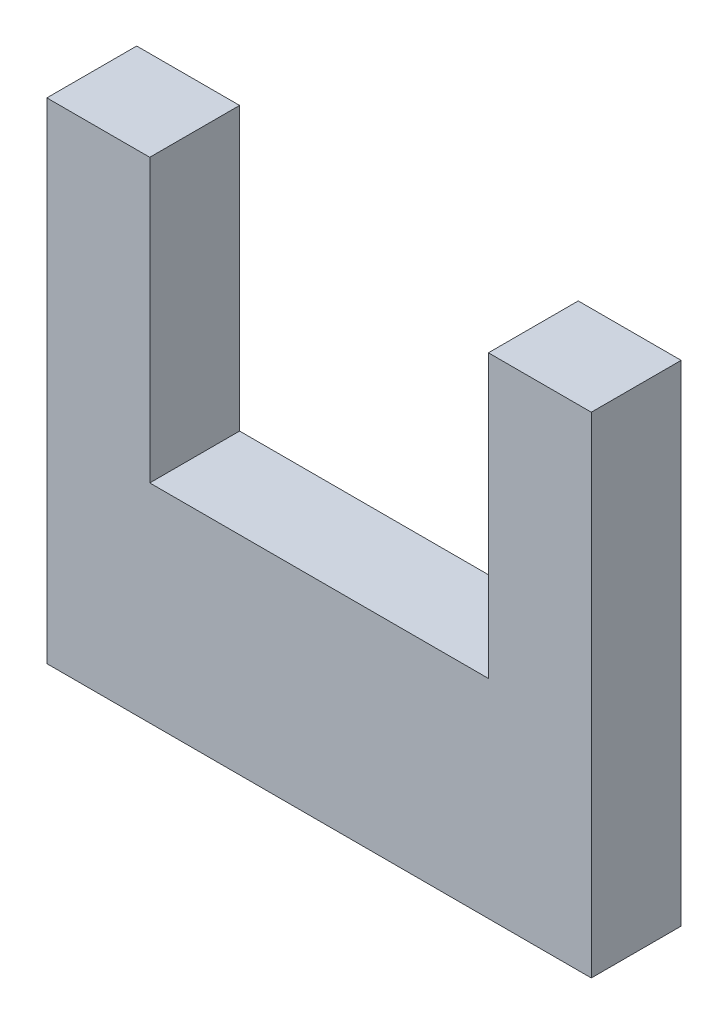
ISO-10303-21;
HEADER;
FILE_DESCRIPTION(('STEP AP214'),'2;1');
FILE_NAME('part.step','',(''),(''),'','','');
FILE_SCHEMA(('AUTOMOTIVE_DESIGN { 1 0 10303 214 1 1 1 1 }'));
ENDSEC;
DATA;
#1=APPLICATION_CONTEXT('core data for automotive mechanical design processes');
#2=APPLICATION_PROTOCOL_DEFINITION('international standard','automotive_design',2000,#1);
#3=PRODUCT_CONTEXT('',#1,'mechanical');
#4=PRODUCT('Part','Part','',(#3));
#5=PRODUCT_RELATED_PRODUCT_CATEGORY('part','',(#4));
#6=PRODUCT_DEFINITION_FORMATION('','',#4);
#7=PRODUCT_DEFINITION_CONTEXT('part definition',#1,'design');
#8=PRODUCT_DEFINITION('design','',#6,#7);
#9=PRODUCT_DEFINITION_SHAPE('','',#8);
#10=(LENGTH_UNIT() NAMED_UNIT(*) SI_UNIT(.MILLI.,.METRE.));
#11=(NAMED_UNIT(*) PLANE_ANGLE_UNIT() SI_UNIT($,.RADIAN.));
#12=(NAMED_UNIT(*) SI_UNIT($,.STERADIAN.) SOLID_ANGLE_UNIT());
#13=UNCERTAINTY_MEASURE_WITH_UNIT(LENGTH_MEASURE(1.E-05),#10,'distance_accuracy_value','');
#14=(GEOMETRIC_REPRESENTATION_CONTEXT(3) GLOBAL_UNCERTAINTY_ASSIGNED_CONTEXT((#13)) GLOBAL_UNIT_ASSIGNED_CONTEXT((#10,
#11,#12)) REPRESENTATION_CONTEXT('',''));
#15=CARTESIAN_POINT('',(0.,0.,0.));
#16=DIRECTION('',(0.,0.,1.));
#17=DIRECTION('',(1.,0.,0.));
#18=AXIS2_PLACEMENT_3D('',#15,#16,#17);
#19=CARTESIAN_POINT('',(5.00000016,4.50000116,0.));
#20=DIRECTION('',(0.,0.,1.));
#21=DIRECTION('',(1.,0.,0.));
#22=AXIS2_PLACEMENT_3D('',#19,#20,#21);
#23=PLANE('',#22);
#24=DIRECTION('',(0.,1.,0.));
#25=VECTOR('',#24,1.);
#26=CARTESIAN_POINT('',(-5.00000016,-4.49999862,0.));
#27=LINE('',#26,#25);
#28=CARTESIAN_POINT('',(-5.00000016,4.50000116,0.));
#29=VERTEX_POINT('',#28);
#30=CARTESIAN_POINT('',(-5.00000016,-4.49999862,0.));
#31=VERTEX_POINT('',#30);
#32=EDGE_CURVE('E125',#29,#31,#27,.F.);
#33=ORIENTED_EDGE('',*,*,#32,.F.);
#34=DIRECTION('',(1.,0.,0.));
#35=VECTOR('',#34,1.);
#36=CARTESIAN_POINT('',(-5.00000016,4.50000116,0.));
#37=LINE('',#36,#35);
#38=CARTESIAN_POINT('',(-3.1100014,4.50000116,0.));
#39=VERTEX_POINT('',#38);
#40=EDGE_CURVE('E122',#39,#29,#37,.F.);
#41=ORIENTED_EDGE('',*,*,#40,.F.);
#42=DIRECTION('',(0.,1.,0.));
#43=VECTOR('',#42,1.);
#44=CARTESIAN_POINT('',(-3.1100014,4.50000116,0.));
#45=LINE('',#44,#43);
#46=CARTESIAN_POINT('',(-3.1100014,-0.67999864,0.));
#47=VERTEX_POINT('',#46);
#48=EDGE_CURVE('E117',#47,#39,#45,.T.);
#49=ORIENTED_EDGE('',*,*,#48,.F.);
#50=DIRECTION('',(1.,0.,0.));
#51=VECTOR('',#50,1.);
#52=CARTESIAN_POINT('',(-3.1100014,-0.67999864,0.));
#53=LINE('',#52,#51);
#54=CARTESIAN_POINT('',(3.1100014,-0.67999864,0.));
#55=VERTEX_POINT('',#54);
#56=EDGE_CURVE('E112',#55,#47,#53,.F.);
#57=ORIENTED_EDGE('',*,*,#56,.F.);
#58=DIRECTION('',(0.,1.,0.));
#59=VECTOR('',#58,1.);
#60=CARTESIAN_POINT('',(3.1100014,-0.67999864,0.));
#61=LINE('',#60,#59);
#62=CARTESIAN_POINT('',(3.1100014,4.50000116,0.));
#63=VERTEX_POINT('',#62);
#64=EDGE_CURVE('E107',#63,#55,#61,.F.);
#65=ORIENTED_EDGE('',*,*,#64,.F.);
#66=DIRECTION('',(1.,0.,0.));
#67=VECTOR('',#66,1.);
#68=CARTESIAN_POINT('',(3.1100014,4.50000116,0.));
#69=LINE('',#68,#67);
#70=CARTESIAN_POINT('',(5.00000016,4.50000116,0.));
#71=VERTEX_POINT('',#70);
#72=EDGE_CURVE('E93',#71,#63,#69,.F.);
#73=ORIENTED_EDGE('',*,*,#72,.F.);
#74=DIRECTION('',(0.,1.,0.));
#75=VECTOR('',#74,1.);
#76=CARTESIAN_POINT('',(5.00000016,4.50000116,0.));
#77=LINE('',#76,#75);
#78=CARTESIAN_POINT('',(5.00000016,-4.49999862,0.));
#79=VERTEX_POINT('',#78);
#80=EDGE_CURVE('E79',#79,#71,#77,.T.);
#81=ORIENTED_EDGE('',*,*,#80,.F.);
#82=DIRECTION('',(1.,0.,0.));
#83=VECTOR('',#82,1.);
#84=CARTESIAN_POINT('',(5.00000016,-4.49999862,0.));
#85=LINE('',#84,#83);
#86=EDGE_CURVE('E20',#31,#79,#85,.T.);
#87=ORIENTED_EDGE('',*,*,#86,.F.);
#88=EDGE_LOOP('',(#33,#41,#49,#57,#65,#73,#81,#87));
#89=FACE_BOUND('',#88,.T.);
#90=ADVANCED_FACE('F17',(#89),#23,.F.);
#91=CARTESIAN_POINT('',(5.00000016,-4.49999862,0.));
#92=DIRECTION('',(0.,-1.,0.));
#93=DIRECTION('',(0.,0.,-1.));
#94=AXIS2_PLACEMENT_3D('',#91,#92,#93);
#95=PLANE('',#94);
#96=DIRECTION('',(0.,0.,-1.));
#97=VECTOR('',#96,1.);
#98=CARTESIAN_POINT('',(5.00000016,-4.49999862,0.));
#99=LINE('',#98,#97);
#100=CARTESIAN_POINT('',(5.00000016,-4.49999862,1.65));
#101=VERTEX_POINT('',#100);
#102=EDGE_CURVE('E85',#101,#79,#99,.T.);
#103=ORIENTED_EDGE('',*,*,#102,.F.);
#104=DIRECTION('',(1.,0.,0.));
#105=VECTOR('',#104,1.);
#106=CARTESIAN_POINT('',(5.00000016,-4.49999862,1.65));
#107=LINE('',#106,#105);
#108=CARTESIAN_POINT('',(-5.00000016,-4.49999862,1.65));
#109=VERTEX_POINT('',#108);
#110=EDGE_CURVE('E128',#109,#101,#107,.T.);
#111=ORIENTED_EDGE('',*,*,#110,.F.);
#112=DIRECTION('',(0.,0.,1.));
#113=VECTOR('',#112,1.);
#114=CARTESIAN_POINT('',(-5.00000016,-4.49999862,0.));
#115=LINE('',#114,#113);
#116=EDGE_CURVE('E88',#31,#109,#115,.T.);
#117=ORIENTED_EDGE('',*,*,#116,.F.);
#118=ORIENTED_EDGE('',*,*,#86,.T.);
#119=EDGE_LOOP('',(#103,#111,#117,#118));
#120=FACE_BOUND('',#119,.T.);
#121=ADVANCED_FACE('F84',(#120),#95,.T.);
#122=CARTESIAN_POINT('',(5.00000016,4.50000116,0.));
#123=DIRECTION('',(1.,0.,0.));
#124=DIRECTION('',(0.,0.,-1.));
#125=AXIS2_PLACEMENT_3D('',#122,#123,#124);
#126=PLANE('',#125);
#127=DIRECTION('',(0.,0.,1.));
#128=VECTOR('',#127,1.);
#129=CARTESIAN_POINT('',(5.00000016,4.50000116,0.));
#130=LINE('',#129,#128);
#131=CARTESIAN_POINT('',(5.00000016,4.50000116,1.65));
#132=VERTEX_POINT('',#131);
#133=EDGE_CURVE('E95',#132,#71,#130,.F.);
#134=ORIENTED_EDGE('',*,*,#133,.F.);
#135=DIRECTION('',(0.,1.,0.));
#136=VECTOR('',#135,1.);
#137=CARTESIAN_POINT('',(5.00000016,4.50000116,1.65));
#138=LINE('',#137,#136);
#139=EDGE_CURVE('E99',#101,#132,#138,.T.);
#140=ORIENTED_EDGE('',*,*,#139,.F.);
#141=ORIENTED_EDGE('',*,*,#102,.T.);
#142=ORIENTED_EDGE('',*,*,#80,.T.);
#143=EDGE_LOOP('',(#134,#140,#141,#142));
#144=FACE_BOUND('',#143,.T.);
#145=ADVANCED_FACE('F97',(#144),#126,.T.);
#146=CARTESIAN_POINT('',(3.1100014,4.50000116,0.));
#147=DIRECTION('',(0.,1.,0.));
#148=DIRECTION('',(0.,0.,1.));
#149=AXIS2_PLACEMENT_3D('',#146,#147,#148);
#150=PLANE('',#149);
#151=DIRECTION('',(0.,0.,1.));
#152=VECTOR('',#151,1.);
#153=CARTESIAN_POINT('',(3.1100014,4.50000116,0.));
#154=LINE('',#153,#152);
#155=CARTESIAN_POINT('',(3.1100014,4.50000116,1.65));
#156=VERTEX_POINT('',#155);
#157=EDGE_CURVE('E104',#156,#63,#154,.F.);
#158=ORIENTED_EDGE('',*,*,#157,.F.);
#159=DIRECTION('',(1.,0.,0.));
#160=VECTOR('',#159,1.);
#161=CARTESIAN_POINT('',(5.00000016,4.50000116,1.65));
#162=LINE('',#161,#160);
#163=EDGE_CURVE('E131',#132,#156,#162,.F.);
#164=ORIENTED_EDGE('',*,*,#163,.F.);
#165=ORIENTED_EDGE('',*,*,#133,.T.);
#166=ORIENTED_EDGE('',*,*,#72,.T.);
#167=EDGE_LOOP('',(#158,#164,#165,#166));
#168=FACE_BOUND('',#167,.T.);
#169=ADVANCED_FACE('F174',(#168),#150,.T.);
#170=CARTESIAN_POINT('',(3.1100014,-0.67999864,0.));
#171=DIRECTION('',(-1.,0.,0.));
#172=DIRECTION('',(0.,0.,1.));
#173=AXIS2_PLACEMENT_3D('',#170,#171,#172);
#174=PLANE('',#173);
#175=DIRECTION('',(0.,0.,1.));
#176=VECTOR('',#175,1.);
#177=CARTESIAN_POINT('',(3.1100014,-0.67999864,0.));
#178=LINE('',#177,#176);
#179=CARTESIAN_POINT('',(3.1100014,-0.67999864,1.65));
#180=VERTEX_POINT('',#179);
#181=EDGE_CURVE('E109',#180,#55,#178,.F.);
#182=ORIENTED_EDGE('',*,*,#181,.F.);
#183=DIRECTION('',(0.,1.,0.));
#184=VECTOR('',#183,1.);
#185=CARTESIAN_POINT('',(3.1100014,4.50000116,1.65));
#186=LINE('',#185,#184);
#187=EDGE_CURVE('E134',#156,#180,#186,.F.);
#188=ORIENTED_EDGE('',*,*,#187,.F.);
#189=ORIENTED_EDGE('',*,*,#157,.T.);
#190=ORIENTED_EDGE('',*,*,#64,.T.);
#191=EDGE_LOOP('',(#182,#188,#189,#190));
#192=FACE_BOUND('',#191,.T.);
#193=ADVANCED_FACE('F170',(#192),#174,.T.);
#194=CARTESIAN_POINT('',(-3.1100014,-0.67999864,0.));
#195=DIRECTION('',(0.,1.,0.));
#196=DIRECTION('',(0.,0.,1.));
#197=AXIS2_PLACEMENT_3D('',#194,#195,#196);
#198=PLANE('',#197);
#199=DIRECTION('',(0.,0.,-1.));
#200=VECTOR('',#199,1.);
#201=CARTESIAN_POINT('',(-3.1100014,-0.67999864,0.));
#202=LINE('',#201,#200);
#203=CARTESIAN_POINT('',(-3.1100014,-0.67999864,1.65));
#204=VERTEX_POINT('',#203);
#205=EDGE_CURVE('E114',#204,#47,#202,.T.);
#206=ORIENTED_EDGE('',*,*,#205,.F.);
#207=DIRECTION('',(1.,0.,0.));
#208=VECTOR('',#207,1.);
#209=CARTESIAN_POINT('',(5.00000016,-0.67999864,1.65));
#210=LINE('',#209,#208);
#211=EDGE_CURVE('E137',#180,#204,#210,.F.);
#212=ORIENTED_EDGE('',*,*,#211,.F.);
#213=ORIENTED_EDGE('',*,*,#181,.T.);
#214=ORIENTED_EDGE('',*,*,#56,.T.);
#215=EDGE_LOOP('',(#206,#212,#213,#214));
#216=FACE_BOUND('',#215,.T.);
#217=ADVANCED_FACE('F167',(#216),#198,.T.);
#218=CARTESIAN_POINT('',(-3.1100014,4.50000116,0.));
#219=DIRECTION('',(1.,0.,0.));
#220=DIRECTION('',(0.,0.,-1.));
#221=AXIS2_PLACEMENT_3D('',#218,#219,#220);
#222=PLANE('',#221);
#223=DIRECTION('',(0.,0.,1.));
#224=VECTOR('',#223,1.);
#225=CARTESIAN_POINT('',(-3.1100014,4.50000116,0.));
#226=LINE('',#225,#224);
#227=CARTESIAN_POINT('',(-3.1100014,4.50000116,1.65));
#228=VERTEX_POINT('',#227);
#229=EDGE_CURVE('E119',#228,#39,#226,.F.);
#230=ORIENTED_EDGE('',*,*,#229,.F.);
#231=DIRECTION('',(0.,1.,0.));
#232=VECTOR('',#231,1.);
#233=CARTESIAN_POINT('',(-3.1100014,4.50000116,1.65));
#234=LINE('',#233,#232);
#235=EDGE_CURVE('E140',#204,#228,#234,.T.);
#236=ORIENTED_EDGE('',*,*,#235,.F.);
#237=ORIENTED_EDGE('',*,*,#205,.T.);
#238=ORIENTED_EDGE('',*,*,#48,.T.);
#239=EDGE_LOOP('',(#230,#236,#237,#238));
#240=FACE_BOUND('',#239,.T.);
#241=ADVANCED_FACE('F150',(#240),#222,.T.);
#242=CARTESIAN_POINT('',(-5.00000016,4.50000116,0.));
#243=DIRECTION('',(0.,1.,0.));
#244=DIRECTION('',(0.,0.,1.));
#245=AXIS2_PLACEMENT_3D('',#242,#243,#244);
#246=PLANE('',#245);
#247=DIRECTION('',(0.,0.,1.));
#248=VECTOR('',#247,1.);
#249=CARTESIAN_POINT('',(-5.00000016,4.50000116,0.));
#250=LINE('',#249,#248);
#251=CARTESIAN_POINT('',(-5.00000016,4.50000116,1.65));
#252=VERTEX_POINT('',#251);
#253=EDGE_CURVE('E35',#252,#29,#250,.F.);
#254=ORIENTED_EDGE('',*,*,#253,.F.);
#255=DIRECTION('',(1.,0.,0.));
#256=VECTOR('',#255,1.);
#257=CARTESIAN_POINT('',(5.00000016,4.50000116,1.65));
#258=LINE('',#257,#256);
#259=EDGE_CURVE('E26',#228,#252,#258,.F.);
#260=ORIENTED_EDGE('',*,*,#259,.F.);
#261=ORIENTED_EDGE('',*,*,#229,.T.);
#262=ORIENTED_EDGE('',*,*,#40,.T.);
#263=EDGE_LOOP('',(#254,#260,#261,#262));
#264=FACE_BOUND('',#263,.T.);
#265=ADVANCED_FACE('F147',(#264),#246,.T.);
#266=CARTESIAN_POINT('',(-5.00000016,-4.49999862,0.));
#267=DIRECTION('',(-1.,0.,0.));
#268=DIRECTION('',(0.,0.,1.));
#269=AXIS2_PLACEMENT_3D('',#266,#267,#268);
#270=PLANE('',#269);
#271=ORIENTED_EDGE('',*,*,#116,.T.);
#272=DIRECTION('',(0.,1.,0.));
#273=VECTOR('',#272,1.);
#274=CARTESIAN_POINT('',(-5.00000016,4.50000116,1.65));
#275=LINE('',#274,#273);
#276=EDGE_CURVE('E11',#252,#109,#275,.F.);
#277=ORIENTED_EDGE('',*,*,#276,.F.);
#278=ORIENTED_EDGE('',*,*,#253,.T.);
#279=ORIENTED_EDGE('',*,*,#32,.T.);
#280=EDGE_LOOP('',(#271,#277,#278,#279));
#281=FACE_BOUND('',#280,.T.);
#282=ADVANCED_FACE('F154',(#281),#270,.T.);
#283=CARTESIAN_POINT('',(5.00000016,4.50000116,1.65));
#284=DIRECTION('',(0.,0.,1.));
#285=DIRECTION('',(1.,0.,0.));
#286=AXIS2_PLACEMENT_3D('',#283,#284,#285);
#287=PLANE('',#286);
#288=ORIENTED_EDGE('',*,*,#259,.T.);
#289=ORIENTED_EDGE('',*,*,#276,.T.);
#290=ORIENTED_EDGE('',*,*,#110,.T.);
#291=ORIENTED_EDGE('',*,*,#139,.T.);
#292=ORIENTED_EDGE('',*,*,#163,.T.);
#293=ORIENTED_EDGE('',*,*,#187,.T.);
#294=ORIENTED_EDGE('',*,*,#211,.T.);
#295=ORIENTED_EDGE('',*,*,#235,.T.);
#296=EDGE_LOOP('',(#288,#289,#290,#291,#292,#293,#294,#295));
#297=FACE_BOUND('',#296,.T.);
#298=ADVANCED_FACE('F145',(#297),#287,.T.);
#299=CLOSED_SHELL('',(#90,#121,#145,#169,#193,#217,#241,#265,#282,#298));
#300=MANIFOLD_SOLID_BREP('B1',#299);
#301=ADVANCED_BREP_SHAPE_REPRESENTATION('',(#18,#300),#14);
#302=SHAPE_DEFINITION_REPRESENTATION(#9,#301);
ENDSEC;
END-ISO-10303-21;
